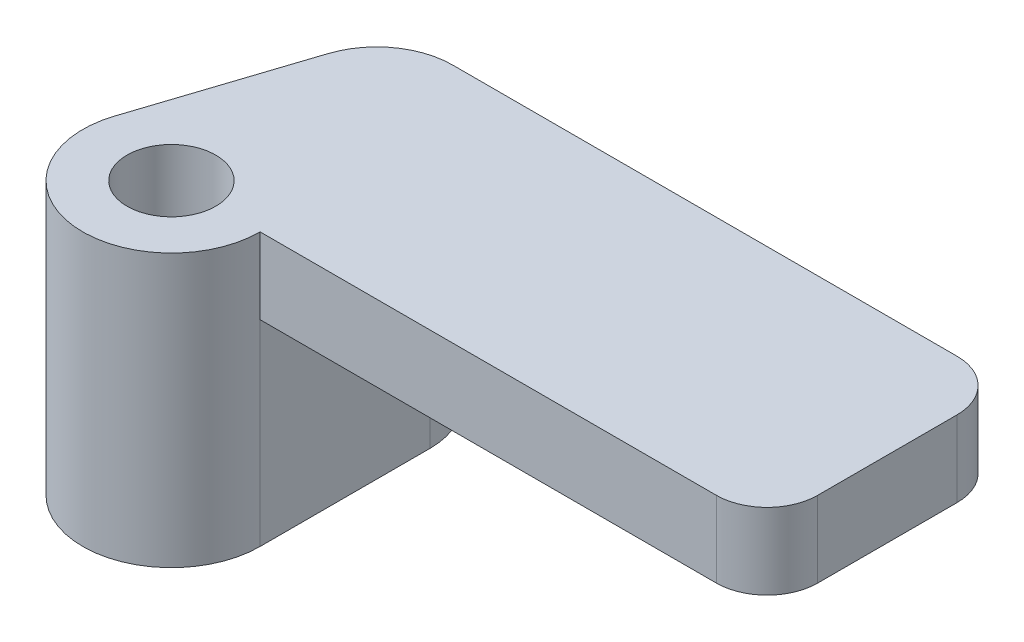
ISO-10303-21;
HEADER;
FILE_DESCRIPTION(('STEP AP214'),'2;1');
FILE_NAME('part.step','',(''),(''),'','','');
FILE_SCHEMA(('AUTOMOTIVE_DESIGN { 1 0 10303 214 1 1 1 1 }'));
ENDSEC;
DATA;
#1=APPLICATION_CONTEXT('core data for automotive mechanical design processes');
#2=APPLICATION_PROTOCOL_DEFINITION('international standard','automotive_design',2000,#1);
#3=PRODUCT_CONTEXT('',#1,'mechanical');
#4=PRODUCT('Part','Part','',(#3));
#5=PRODUCT_RELATED_PRODUCT_CATEGORY('part','',(#4));
#6=PRODUCT_DEFINITION_FORMATION('','',#4);
#7=PRODUCT_DEFINITION_CONTEXT('part definition',#1,'design');
#8=PRODUCT_DEFINITION('design','',#6,#7);
#9=PRODUCT_DEFINITION_SHAPE('','',#8);
#10=(LENGTH_UNIT() NAMED_UNIT(*) SI_UNIT(.MILLI.,.METRE.));
#11=(NAMED_UNIT(*) PLANE_ANGLE_UNIT() SI_UNIT($,.RADIAN.));
#12=(NAMED_UNIT(*) SI_UNIT($,.STERADIAN.) SOLID_ANGLE_UNIT());
#13=UNCERTAINTY_MEASURE_WITH_UNIT(LENGTH_MEASURE(1.E-05),#10,'distance_accuracy_value','');
#14=(GEOMETRIC_REPRESENTATION_CONTEXT(3) GLOBAL_UNCERTAINTY_ASSIGNED_CONTEXT((#13)) GLOBAL_UNIT_ASSIGNED_CONTEXT((#10,
#11,#12)) REPRESENTATION_CONTEXT('',''));
#15=CARTESIAN_POINT('',(0.,0.,0.));
#16=DIRECTION('',(0.,0.,1.));
#17=DIRECTION('',(1.,0.,0.));
#18=AXIS2_PLACEMENT_3D('',#15,#16,#17);
#19=CARTESIAN_POINT('',(10.,3.,4.75));
#20=DIRECTION('',(-1.,0.,0.));
#21=DIRECTION('',(0.,0.,1.));
#22=AXIS2_PLACEMENT_3D('',#19,#20,#21);
#23=PLANE('',#22);
#24=DIRECTION('',(0.,0.,-1.));
#25=VECTOR('',#24,1.);
#26=CARTESIAN_POINT('',(10.,0.,4.75));
#27=LINE('',#26,#25);
#28=CARTESIAN_POINT('',(10.,0.,2.75));
#29=VERTEX_POINT('',#28);
#30=CARTESIAN_POINT('',(10.,0.,-2.75));
#31=VERTEX_POINT('',#30);
#32=EDGE_CURVE('E150',#29,#31,#27,.T.);
#33=ORIENTED_EDGE('',*,*,#32,.T.);
#34=DIRECTION('',(0.,-1.,0.));
#35=VECTOR('',#34,1.);
#36=CARTESIAN_POINT('',(10.,3.,-2.75));
#37=LINE('',#36,#35);
#38=CARTESIAN_POINT('',(10.,3.,-2.75));
#39=VERTEX_POINT('',#38);
#40=EDGE_CURVE('E54',#31,#39,#37,.F.);
#41=ORIENTED_EDGE('',*,*,#40,.T.);
#42=DIRECTION('',(0.,0.,-1.));
#43=VECTOR('',#42,1.);
#44=CARTESIAN_POINT('',(10.,3.,4.75));
#45=LINE('',#44,#43);
#46=CARTESIAN_POINT('',(10.,3.,2.75));
#47=VERTEX_POINT('',#46);
#48=EDGE_CURVE('E152',#47,#39,#45,.T.);
#49=ORIENTED_EDGE('',*,*,#48,.F.);
#50=DIRECTION('',(0.,-1.,0.));
#51=VECTOR('',#50,1.);
#52=CARTESIAN_POINT('',(10.,3.,2.75));
#53=LINE('',#52,#51);
#54=EDGE_CURVE('E190',#47,#29,#53,.T.);
#55=ORIENTED_EDGE('',*,*,#54,.T.);
#56=EDGE_LOOP('',(#33,#41,#49,#55));
#57=FACE_BOUND('',#56,.T.);
#58=ADVANCED_FACE('F33',(#57),#23,.F.);
#59=CARTESIAN_POINT('',(-10.,3.,-4.75));
#60=DIRECTION('',(0.,0.,1.));
#61=DIRECTION('',(1.,0.,0.));
#62=AXIS2_PLACEMENT_3D('',#59,#60,#61);
#63=PLANE('',#62);
#64=DIRECTION('',(-1.,0.,0.));
#65=VECTOR('',#64,1.);
#66=CARTESIAN_POINT('',(-10.,3.,-4.75));
#67=LINE('',#66,#65);
#68=CARTESIAN_POINT('',(8.,3.,-4.75));
#69=VERTEX_POINT('',#68);
#70=CARTESIAN_POINT('',(-11.9003567890584,3.,-4.75));
#71=VERTEX_POINT('',#70);
#72=EDGE_CURVE('E154',#69,#71,#67,.T.);
#73=ORIENTED_EDGE('',*,*,#72,.F.);
#74=DIRECTION('',(0.,-1.,0.));
#75=VECTOR('',#74,1.);
#76=CARTESIAN_POINT('',(8.,3.,-4.75));
#77=LINE('',#76,#75);
#78=CARTESIAN_POINT('',(8.,0.,-4.75));
#79=VERTEX_POINT('',#78);
#80=EDGE_CURVE('E183',#69,#79,#77,.T.);
#81=ORIENTED_EDGE('',*,*,#80,.T.);
#82=DIRECTION('',(-1.,0.,0.));
#83=VECTOR('',#82,1.);
#84=CARTESIAN_POINT('',(-10.,0.,-4.75));
#85=LINE('',#84,#83);
#86=CARTESIAN_POINT('',(-11.9003567890584,0.,-4.75));
#87=VERTEX_POINT('',#86);
#88=EDGE_CURVE('E161',#79,#87,#85,.T.);
#89=ORIENTED_EDGE('',*,*,#88,.T.);
#90=DIRECTION('',(0.,1.,0.));
#91=VECTOR('',#90,1.);
#92=CARTESIAN_POINT('',(-11.9003567890584,3.,-4.75));
#93=LINE('',#92,#91);
#94=EDGE_CURVE('E167',#87,#71,#93,.T.);
#95=ORIENTED_EDGE('',*,*,#94,.T.);
#96=EDGE_LOOP('',(#73,#81,#89,#95));
#97=FACE_BOUND('',#96,.T.);
#98=ADVANCED_FACE('F204',(#97),#63,.F.);
#99=CARTESIAN_POINT('',(-10.,3.,4.75));
#100=DIRECTION('',(0.,0.,-1.));
#101=DIRECTION('',(-1.,0.,0.));
#102=AXIS2_PLACEMENT_3D('',#99,#100,#101);
#103=PLANE('',#102);
#104=DIRECTION('',(1.,0.,0.));
#105=VECTOR('',#104,1.);
#106=CARTESIAN_POINT('',(-10.,0.,4.75));
#107=LINE('',#106,#105);
#108=CARTESIAN_POINT('',(-10.,0.,4.75));
#109=VERTEX_POINT('',#108);
#110=CARTESIAN_POINT('',(8.,0.,4.75));
#111=VERTEX_POINT('',#110);
#112=EDGE_CURVE('E155',#109,#111,#107,.T.);
#113=ORIENTED_EDGE('',*,*,#112,.T.);
#114=DIRECTION('',(0.,-1.,0.));
#115=VECTOR('',#114,1.);
#116=CARTESIAN_POINT('',(8.,3.,4.75));
#117=LINE('',#116,#115);
#118=CARTESIAN_POINT('',(8.,3.,4.75));
#119=VERTEX_POINT('',#118);
#120=EDGE_CURVE('E11',#111,#119,#117,.F.);
#121=ORIENTED_EDGE('',*,*,#120,.T.);
#122=DIRECTION('',(1.,0.,0.));
#123=VECTOR('',#122,1.);
#124=CARTESIAN_POINT('',(-10.,3.,4.75));
#125=LINE('',#124,#123);
#126=CARTESIAN_POINT('',(-10.,3.,4.75));
#127=VERTEX_POINT('',#126);
#128=EDGE_CURVE('E157',#127,#119,#125,.T.);
#129=ORIENTED_EDGE('',*,*,#128,.F.);
#130=DIRECTION('',(0.,-1.,0.));
#131=VECTOR('',#130,1.);
#132=CARTESIAN_POINT('',(-10.,3.,4.75));
#133=LINE('',#132,#131);
#134=EDGE_CURVE('E159',#127,#109,#133,.T.);
#135=ORIENTED_EDGE('',*,*,#134,.T.);
#136=EDGE_LOOP('',(#113,#121,#129,#135));
#137=FACE_BOUND('',#136,.T.);
#138=ADVANCED_FACE('F215',(#137),#103,.F.);
#139=CARTESIAN_POINT('',(0.,3.,0.));
#140=DIRECTION('',(0.,-1.,0.));
#141=DIRECTION('',(0.,0.,-1.));
#142=AXIS2_PLACEMENT_3D('',#139,#140,#141);
#143=PLANE('',#142);
#144=ORIENTED_EDGE('',*,*,#48,.T.);
#145=CARTESIAN_POINT('',(8.,3.,-2.75));
#146=DIRECTION('',(0.,-1.,0.));
#147=DIRECTION('',(0.,0.,-1.));
#148=AXIS2_PLACEMENT_3D('',#145,#146,#147);
#149=CIRCLE('',#148,2.);
#150=EDGE_CURVE('E41',#39,#69,#149,.F.);
#151=ORIENTED_EDGE('',*,*,#150,.T.);
#152=ORIENTED_EDGE('',*,*,#72,.T.);
#153=CARTESIAN_POINT('',(-11.9003567890584,3.,-1.75));
#154=DIRECTION('',(0.,-1.,0.));
#155=DIRECTION('',(0.,0.,-1.));
#156=AXIS2_PLACEMENT_3D('',#153,#154,#155);
#157=CIRCLE('',#156,3.);
#158=CARTESIAN_POINT('',(-14.7517518613888,3.,-2.68249457987162));
#159=VERTEX_POINT('',#158);
#160=EDGE_CURVE('E171',#71,#159,#157,.F.);
#161=ORIENTED_EDGE('',*,*,#160,.T.);
#162=DIRECTION('',(-0.310831526623873,0.,0.950465024110131));
#163=VECTOR('',#162,1.);
#164=CARTESIAN_POINT('',(-14.0756134978091,3.,-4.75));
#165=LINE('',#164,#163);
#166=CARTESIAN_POINT('',(-16.8266275843855,3.,3.66208965681644));
#167=VERTEX_POINT('',#166);
#168=EDGE_CURVE('E138',#159,#167,#165,.T.);
#169=ORIENTED_EDGE('',*,*,#168,.T.);
#170=CARTESIAN_POINT('',(-13.5,3.,4.75));
#171=DIRECTION('',(0.,1.,0.));
#172=DIRECTION('',(0.,0.,1.));
#173=AXIS2_PLACEMENT_3D('',#170,#171,#172);
#174=CIRCLE('',#173,3.5);
#175=EDGE_CURVE('E140',#167,#127,#174,.T.);
#176=ORIENTED_EDGE('',*,*,#175,.T.);
#177=ORIENTED_EDGE('',*,*,#128,.T.);
#178=CARTESIAN_POINT('',(8.,3.,2.75));
#179=DIRECTION('',(0.,-1.,0.));
#180=DIRECTION('',(0.,0.,-1.));
#181=AXIS2_PLACEMENT_3D('',#178,#179,#180);
#182=CIRCLE('',#181,2.);
#183=EDGE_CURVE('E194',#119,#47,#182,.F.);
#184=ORIENTED_EDGE('',*,*,#183,.T.);
#185=EDGE_LOOP('',(#144,#151,#152,#161,#169,#176,#177,#184));
#186=FACE_BOUND('',#185,.T.);
#187=CARTESIAN_POINT('',(-13.5,3.,4.75));
#188=DIRECTION('',(0.,1.,0.));
#189=DIRECTION('',(0.,0.,1.));
#190=AXIS2_PLACEMENT_3D('',#187,#188,#189);
#191=CIRCLE('',#190,1.75);
#192=CARTESIAN_POINT('',(-13.5,3.,6.5));
#193=VERTEX_POINT('',#192);
#194=EDGE_CURVE('E143',#193,#193,#191,.T.);
#195=ORIENTED_EDGE('',*,*,#194,.F.);
#196=EDGE_LOOP('',(#195));
#197=FACE_BOUND('',#196,.T.);
#198=ADVANCED_FACE('F198',(#186,#197),#143,.F.);
#199=CARTESIAN_POINT('',(0.,0.,0.));
#200=DIRECTION('',(0.,-1.,0.));
#201=DIRECTION('',(0.,0.,-1.));
#202=AXIS2_PLACEMENT_3D('',#199,#200,#201);
#203=PLANE('',#202);
#204=ORIENTED_EDGE('',*,*,#88,.F.);
#205=CARTESIAN_POINT('',(8.,0.,-2.75));
#206=DIRECTION('',(0.,-1.,0.));
#207=DIRECTION('',(0.,0.,-1.));
#208=AXIS2_PLACEMENT_3D('',#205,#206,#207);
#209=CIRCLE('',#208,2.);
#210=EDGE_CURVE('E188',#79,#31,#209,.T.);
#211=ORIENTED_EDGE('',*,*,#210,.T.);
#212=ORIENTED_EDGE('',*,*,#32,.F.);
#213=CARTESIAN_POINT('',(8.,0.,2.75));
#214=DIRECTION('',(0.,-1.,0.));
#215=DIRECTION('',(0.,0.,-1.));
#216=AXIS2_PLACEMENT_3D('',#213,#214,#215);
#217=CIRCLE('',#216,2.);
#218=EDGE_CURVE('E186',#29,#111,#217,.T.);
#219=ORIENTED_EDGE('',*,*,#218,.T.);
#220=ORIENTED_EDGE('',*,*,#112,.F.);
#221=DIRECTION('',(0.,0.,1.));
#222=VECTOR('',#221,1.);
#223=CARTESIAN_POINT('',(-10.,0.,4.75));
#224=LINE('',#223,#222);
#225=CARTESIAN_POINT('',(-10.,0.,-1.95880226271406));
#226=VERTEX_POINT('',#225);
#227=EDGE_CURVE('E118',#226,#109,#224,.T.);
#228=ORIENTED_EDGE('',*,*,#227,.F.);
#229=CARTESIAN_POINT('',(-13.,0.,-1.95880226271406));
#230=DIRECTION('',(0.,-1.,0.));
#231=DIRECTION('',(0.,0.,-1.));
#232=AXIS2_PLACEMENT_3D('',#229,#230,#231);
#233=CIRCLE('',#232,3.);
#234=EDGE_CURVE('E180',#226,#87,#233,.F.);
#235=ORIENTED_EDGE('',*,*,#234,.T.);
#236=EDGE_LOOP('',(#204,#211,#212,#219,#220,#228,#235));
#237=FACE_BOUND('',#236,.T.);
#238=ADVANCED_FACE('F211',(#237),#203,.T.);
#239=CARTESIAN_POINT('',(-13.5,-7.75,4.75));
#240=DIRECTION('',(0.,1.,0.));
#241=DIRECTION('',(0.,0.,1.));
#242=AXIS2_PLACEMENT_3D('',#239,#240,#241);
#243=CYLINDRICAL_SURFACE('',#242,3.5);
#244=ORIENTED_EDGE('',*,*,#175,.F.);
#245=DIRECTION('',(0.,1.,0.));
#246=VECTOR('',#245,1.);
#247=CARTESIAN_POINT('',(-16.8266275843855,-7.75,3.66208965681644));
#248=LINE('',#247,#246);
#249=CARTESIAN_POINT('',(-16.8266275843855,-7.75,3.66208965681644));
#250=VERTEX_POINT('',#249);
#251=EDGE_CURVE('E123',#250,#167,#248,.T.);
#252=ORIENTED_EDGE('',*,*,#251,.F.);
#253=CARTESIAN_POINT('',(-13.5,-7.75,4.75));
#254=DIRECTION('',(0.,1.,0.));
#255=DIRECTION('',(0.,0.,1.));
#256=AXIS2_PLACEMENT_3D('',#253,#254,#255);
#257=CIRCLE('',#256,3.5);
#258=CARTESIAN_POINT('',(-10.,-7.75,4.75));
#259=VERTEX_POINT('',#258);
#260=EDGE_CURVE('E130',#250,#259,#257,.T.);
#261=ORIENTED_EDGE('',*,*,#260,.T.);
#262=DIRECTION('',(0.,1.,0.));
#263=VECTOR('',#262,1.);
#264=CARTESIAN_POINT('',(-10.,-7.75,4.75));
#265=LINE('',#264,#263);
#266=EDGE_CURVE('E111',#259,#109,#265,.T.);
#267=ORIENTED_EDGE('',*,*,#266,.T.);
#268=ORIENTED_EDGE('',*,*,#134,.F.);
#269=EDGE_LOOP('',(#244,#252,#261,#267,#268));
#270=FACE_BOUND('',#269,.T.);
#271=ADVANCED_FACE('F136',(#270),#243,.T.);
#272=CARTESIAN_POINT('',(-14.0756134978091,-7.75,-4.75));
#273=DIRECTION('',(-0.950465024110131,0.,-0.310831526623873));
#274=DIRECTION('',(-0.310831526623873,0.,0.950465024110131));
#275=AXIS2_PLACEMENT_3D('',#272,#273,#274);
#276=PLANE('',#275);
#277=ORIENTED_EDGE('',*,*,#168,.F.);
#278=DIRECTION('',(0.,1.,0.));
#279=VECTOR('',#278,1.);
#280=CARTESIAN_POINT('',(-14.7517518613888,-7.75,-2.68249457987162));
#281=LINE('',#280,#279);
#282=CARTESIAN_POINT('',(-14.7517518613888,-7.75,-2.68249457987162));
#283=VERTEX_POINT('',#282);
#284=EDGE_CURVE('E173',#159,#283,#281,.F.);
#285=ORIENTED_EDGE('',*,*,#284,.T.);
#286=DIRECTION('',(-0.310831526623873,0.,0.950465024110131));
#287=VECTOR('',#286,1.);
#288=CARTESIAN_POINT('',(-14.0756134978091,-7.75,-4.75));
#289=LINE('',#288,#287);
#290=EDGE_CURVE('E124',#283,#250,#289,.T.);
#291=ORIENTED_EDGE('',*,*,#290,.T.);
#292=ORIENTED_EDGE('',*,*,#251,.T.);
#293=EDGE_LOOP('',(#277,#285,#291,#292));
#294=FACE_BOUND('',#293,.T.);
#295=ADVANCED_FACE('F219',(#294),#276,.T.);
#296=CARTESIAN_POINT('',(-10.,-7.75,-4.75));
#297=DIRECTION('',(1.,0.,0.));
#298=DIRECTION('',(0.,0.,-1.));
#299=AXIS2_PLACEMENT_3D('',#296,#297,#298);
#300=PLANE('',#299);
#301=DIRECTION('',(0.,0.,-1.));
#302=VECTOR('',#301,1.);
#303=CARTESIAN_POINT('',(-10.,-7.75,-4.75));
#304=LINE('',#303,#302);
#305=CARTESIAN_POINT('',(-10.,-7.75,-1.95880226271406));
#306=VERTEX_POINT('',#305);
#307=EDGE_CURVE('E115',#259,#306,#304,.T.);
#308=ORIENTED_EDGE('',*,*,#307,.T.);
#309=DIRECTION('',(0.,-1.,0.));
#310=VECTOR('',#309,1.);
#311=CARTESIAN_POINT('',(-10.,0.,-1.95880226271406));
#312=LINE('',#311,#310);
#313=EDGE_CURVE('E177',#306,#226,#312,.F.);
#314=ORIENTED_EDGE('',*,*,#313,.T.);
#315=ORIENTED_EDGE('',*,*,#227,.T.);
#316=ORIENTED_EDGE('',*,*,#266,.F.);
#317=EDGE_LOOP('',(#308,#314,#315,#316));
#318=FACE_BOUND('',#317,.T.);
#319=ADVANCED_FACE('F113',(#318),#300,.T.);
#320=CARTESIAN_POINT('',(-13.5,-7.75,4.75));
#321=DIRECTION('',(0.,1.,0.));
#322=DIRECTION('',(0.,0.,1.));
#323=AXIS2_PLACEMENT_3D('',#320,#321,#322);
#324=PLANE('',#323);
#325=CARTESIAN_POINT('',(-13.5,-7.75,4.75));
#326=DIRECTION('',(0.,1.,0.));
#327=DIRECTION('',(0.,0.,1.));
#328=AXIS2_PLACEMENT_3D('',#325,#326,#327);
#329=CIRCLE('',#328,1.75);
#330=CARTESIAN_POINT('',(-13.5,-7.75,6.5));
#331=VERTEX_POINT('',#330);
#332=EDGE_CURVE('E148',#331,#331,#329,.T.);
#333=ORIENTED_EDGE('',*,*,#332,.T.);
#334=EDGE_LOOP('',(#333));
#335=FACE_BOUND('',#334,.T.);
#336=CARTESIAN_POINT('',(-11.9003567890584,-7.75,-1.75));
#337=DIRECTION('',(0.,1.,0.));
#338=DIRECTION('',(0.,0.,1.));
#339=AXIS2_PLACEMENT_3D('',#336,#337,#338);
#340=CIRCLE('',#339,3.);
#341=CARTESIAN_POINT('',(-11.9003567890584,-7.75,-4.75));
#342=VERTEX_POINT('',#341);
#343=EDGE_CURVE('E175',#283,#342,#340,.F.);
#344=ORIENTED_EDGE('',*,*,#343,.T.);
#345=CARTESIAN_POINT('',(-13.,-7.75,-1.95880226271406));
#346=DIRECTION('',(0.,1.,0.));
#347=DIRECTION('',(0.,0.,1.));
#348=AXIS2_PLACEMENT_3D('',#345,#346,#347);
#349=CIRCLE('',#348,3.);
#350=EDGE_CURVE('E132',#342,#306,#349,.F.);
#351=ORIENTED_EDGE('',*,*,#350,.T.);
#352=ORIENTED_EDGE('',*,*,#307,.F.);
#353=ORIENTED_EDGE('',*,*,#260,.F.);
#354=ORIENTED_EDGE('',*,*,#290,.F.);
#355=EDGE_LOOP('',(#344,#351,#352,#353,#354));
#356=FACE_BOUND('',#355,.T.);
#357=ADVANCED_FACE('F128',(#335,#356),#324,.F.);
#358=CARTESIAN_POINT('',(-13.5,-7.75,4.75));
#359=DIRECTION('',(0.,1.,0.));
#360=DIRECTION('',(0.,0.,1.));
#361=AXIS2_PLACEMENT_3D('',#358,#359,#360);
#362=CYLINDRICAL_SURFACE('',#361,1.75);
#363=ORIENTED_EDGE('',*,*,#332,.F.);
#364=EDGE_LOOP('',(#363));
#365=FACE_BOUND('',#364,.T.);
#366=ORIENTED_EDGE('',*,*,#194,.T.);
#367=EDGE_LOOP('',(#366));
#368=FACE_BOUND('',#367,.T.);
#369=ADVANCED_FACE('F232',(#365,#368),#362,.F.);
#370=CARTESIAN_POINT('',(-11.9003567890584,3.,-1.75));
#371=DIRECTION('',(0.,-1.,0.));
#372=DIRECTION('',(0.,0.,-1.));
#373=AXIS2_PLACEMENT_3D('',#370,#371,#372);
#374=CYLINDRICAL_SURFACE('',#373,3.);
#375=ORIENTED_EDGE('',*,*,#343,.F.);
#376=ORIENTED_EDGE('',*,*,#284,.F.);
#377=ORIENTED_EDGE('',*,*,#160,.F.);
#378=ORIENTED_EDGE('',*,*,#94,.F.);
#379=EDGE_CURVE('E168',#342,#87,#93,.T.);
#380=ORIENTED_EDGE('',*,*,#379,.F.);
#381=EDGE_LOOP('',(#375,#376,#377,#378,#380));
#382=FACE_BOUND('',#381,.T.);
#383=ADVANCED_FACE('F223',(#382),#374,.T.);
#384=CARTESIAN_POINT('',(-13.,3.,-1.95880226271406));
#385=DIRECTION('',(0.,1.,0.));
#386=DIRECTION('',(0.,0.,1.));
#387=AXIS2_PLACEMENT_3D('',#384,#385,#386);
#388=CYLINDRICAL_SURFACE('',#387,3.);
#389=ORIENTED_EDGE('',*,*,#350,.F.);
#390=ORIENTED_EDGE('',*,*,#379,.T.);
#391=ORIENTED_EDGE('',*,*,#234,.F.);
#392=ORIENTED_EDGE('',*,*,#313,.F.);
#393=EDGE_LOOP('',(#389,#390,#391,#392));
#394=FACE_BOUND('',#393,.T.);
#395=ADVANCED_FACE('F225',(#394),#388,.T.);
#396=CARTESIAN_POINT('',(8.,3.,-2.75));
#397=DIRECTION('',(0.,-1.,0.));
#398=DIRECTION('',(0.,0.,-1.));
#399=AXIS2_PLACEMENT_3D('',#396,#397,#398);
#400=CYLINDRICAL_SURFACE('',#399,2.);
#401=ORIENTED_EDGE('',*,*,#150,.F.);
#402=ORIENTED_EDGE('',*,*,#40,.F.);
#403=ORIENTED_EDGE('',*,*,#210,.F.);
#404=ORIENTED_EDGE('',*,*,#80,.F.);
#405=EDGE_LOOP('',(#401,#402,#403,#404));
#406=FACE_BOUND('',#405,.T.);
#407=ADVANCED_FACE('F208',(#406),#400,.T.);
#408=CARTESIAN_POINT('',(8.,3.,2.75));
#409=DIRECTION('',(0.,-1.,0.));
#410=DIRECTION('',(0.,0.,-1.));
#411=AXIS2_PLACEMENT_3D('',#408,#409,#410);
#412=CYLINDRICAL_SURFACE('',#411,2.);
#413=ORIENTED_EDGE('',*,*,#183,.F.);
#414=ORIENTED_EDGE('',*,*,#120,.F.);
#415=ORIENTED_EDGE('',*,*,#218,.F.);
#416=ORIENTED_EDGE('',*,*,#54,.F.);
#417=EDGE_LOOP('',(#413,#414,#415,#416));
#418=FACE_BOUND('',#417,.T.);
#419=ADVANCED_FACE('F35',(#418),#412,.T.);
#420=CLOSED_SHELL('',(#58,#98,#138,#198,#238,#271,#295,#319,#357,#369,#383,#395,#407,#419));
#421=MANIFOLD_SOLID_BREP('B2',#420);
#422=ADVANCED_BREP_SHAPE_REPRESENTATION('',(#18,#421),#14);
#423=SHAPE_DEFINITION_REPRESENTATION(#9,#422);
ENDSEC;
END-ISO-10303-21;
